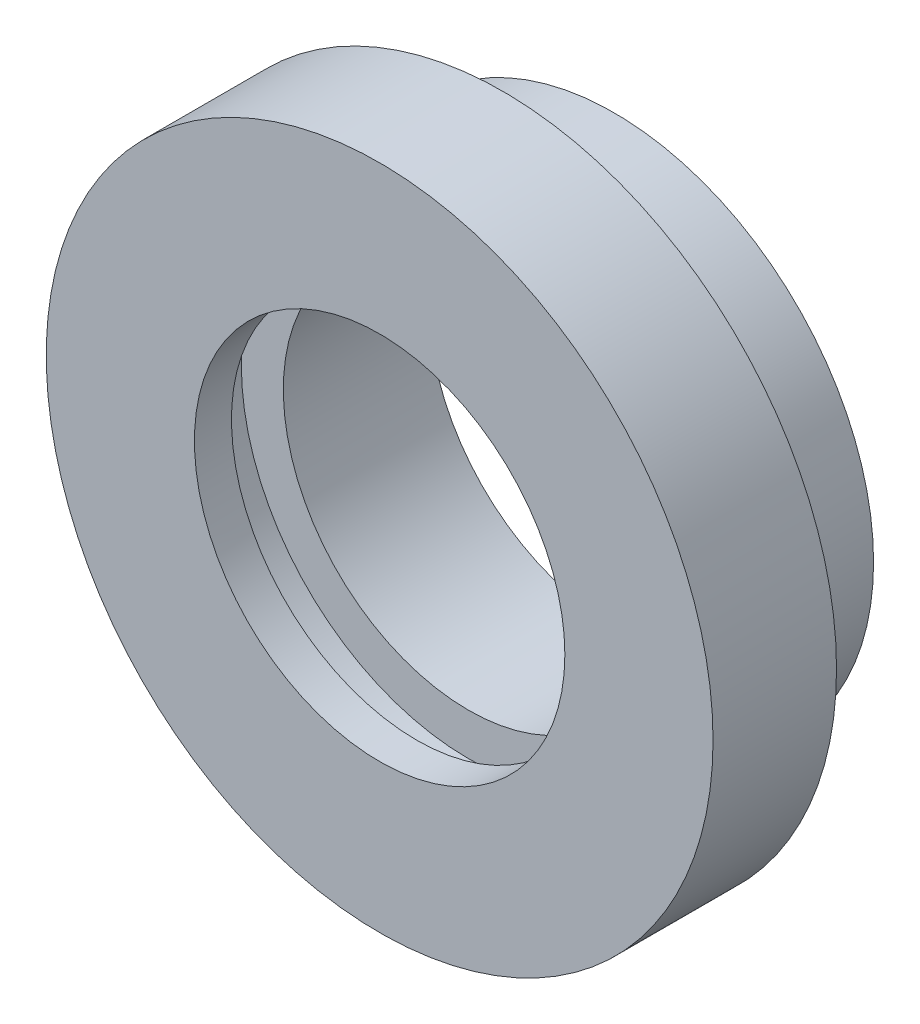
ISO-10303-21;
HEADER;
FILE_DESCRIPTION(('STEP AP214'),'2;1');
FILE_NAME('part.step','',(''),(''),'','','');
FILE_SCHEMA(('AUTOMOTIVE_DESIGN { 1 0 10303 214 1 1 1 1 }'));
ENDSEC;
DATA;
#1=APPLICATION_CONTEXT('core data for automotive mechanical design processes');
#2=APPLICATION_PROTOCOL_DEFINITION('international standard','automotive_design',2000,#1);
#3=PRODUCT_CONTEXT('',#1,'mechanical');
#4=PRODUCT('Part','Part','',(#3));
#5=PRODUCT_RELATED_PRODUCT_CATEGORY('part','',(#4));
#6=PRODUCT_DEFINITION_FORMATION('','',#4);
#7=PRODUCT_DEFINITION_CONTEXT('part definition',#1,'design');
#8=PRODUCT_DEFINITION('design','',#6,#7);
#9=PRODUCT_DEFINITION_SHAPE('','',#8);
#10=(LENGTH_UNIT() NAMED_UNIT(*) SI_UNIT(.MILLI.,.METRE.));
#11=(NAMED_UNIT(*) PLANE_ANGLE_UNIT() SI_UNIT($,.RADIAN.));
#12=(NAMED_UNIT(*) SI_UNIT($,.STERADIAN.) SOLID_ANGLE_UNIT());
#13=UNCERTAINTY_MEASURE_WITH_UNIT(LENGTH_MEASURE(1.E-05),#10,'distance_accuracy_value','');
#14=(GEOMETRIC_REPRESENTATION_CONTEXT(3) GLOBAL_UNCERTAINTY_ASSIGNED_CONTEXT((#13)) GLOBAL_UNIT_ASSIGNED_CONTEXT((#10,
#11,#12)) REPRESENTATION_CONTEXT('',''));
#15=CARTESIAN_POINT('',(0.,0.,0.));
#16=DIRECTION('',(0.,0.,1.));
#17=DIRECTION('',(1.,0.,0.));
#18=AXIS2_PLACEMENT_3D('',#15,#16,#17);
#19=CARTESIAN_POINT('',(0.,0.,0.));
#20=DIRECTION('',(0.,0.,1.));
#21=DIRECTION('',(1.,0.,0.));
#22=AXIS2_PLACEMENT_3D('',#19,#20,#21);
#23=CYLINDRICAL_SURFACE('',#22,15.);
#24=CARTESIAN_POINT('',(0.,0.,-135.));
#25=DIRECTION('',(0.,0.,1.));
#26=DIRECTION('',(1.,0.,0.));
#27=AXIS2_PLACEMENT_3D('',#24,#25,#26);
#28=CIRCLE('',#27,15.);
#29=CARTESIAN_POINT('',(15.,0.,-135.));
#30=VERTEX_POINT('',#29);
#31=EDGE_CURVE('E42',#30,#30,#28,.T.);
#32=ORIENTED_EDGE('',*,*,#31,.T.);
#33=EDGE_LOOP('',(#32));
#34=FACE_BOUND('',#33,.T.);
#35=CARTESIAN_POINT('',(0.,0.,-138.));
#36=DIRECTION('',(0.,0.,1.));
#37=DIRECTION('',(0.,-1.,0.));
#38=AXIS2_PLACEMENT_3D('',#35,#36,#37);
#39=CIRCLE('',#38,15.);
#40=CARTESIAN_POINT('',(0.,-15.,-138.));
#41=VERTEX_POINT('',#40);
#42=EDGE_CURVE('E70',#41,#41,#39,.T.);
#43=ORIENTED_EDGE('',*,*,#42,.F.);
#44=EDGE_LOOP('',(#43));
#45=FACE_BOUND('',#44,.T.);
#46=ADVANCED_FACE('F35',(#34,#45),#23,.F.);
#47=CARTESIAN_POINT('',(0.,0.,-154.));
#48=DIRECTION('',(0.,0.,1.));
#49=DIRECTION('',(1.,0.,0.));
#50=AXIS2_PLACEMENT_3D('',#47,#48,#49);
#51=CIRCLE('',#50,15.);
#52=CARTESIAN_POINT('',(15.,0.,-154.));
#53=VERTEX_POINT('',#52);
#54=EDGE_CURVE('E46',#53,#53,#51,.T.);
#55=ORIENTED_EDGE('',*,*,#54,.F.);
#56=EDGE_LOOP('',(#55));
#57=FACE_BOUND('',#56,.T.);
#58=CARTESIAN_POINT('',(0.,0.,-142.2));
#59=DIRECTION('',(0.,0.,1.));
#60=DIRECTION('',(0.,-1.,0.));
#61=AXIS2_PLACEMENT_3D('',#58,#59,#60);
#62=CIRCLE('',#61,15.);
#63=CARTESIAN_POINT('',(0.,-15.,-142.2));
#64=VERTEX_POINT('',#63);
#65=EDGE_CURVE('E67',#64,#64,#62,.T.);
#66=ORIENTED_EDGE('',*,*,#65,.T.);
#67=EDGE_LOOP('',(#66));
#68=FACE_BOUND('',#67,.T.);
#69=ADVANCED_FACE('F78',(#57,#68),#23,.F.);
#70=CARTESIAN_POINT('',(0.,0.,0.));
#71=DIRECTION('',(0.,0.,1.));
#72=DIRECTION('',(1.,0.,0.));
#73=AXIS2_PLACEMENT_3D('',#70,#71,#72);
#74=CYLINDRICAL_SURFACE('',#73,27.);
#75=CARTESIAN_POINT('',(0.,0.,-135.));
#76=DIRECTION('',(0.,0.,1.));
#77=DIRECTION('',(1.,0.,0.));
#78=AXIS2_PLACEMENT_3D('',#75,#76,#77);
#79=CIRCLE('',#78,27.);
#80=CARTESIAN_POINT('',(27.,0.,-135.));
#81=VERTEX_POINT('',#80);
#82=EDGE_CURVE('E10',#81,#81,#79,.T.);
#83=ORIENTED_EDGE('',*,*,#82,.F.);
#84=EDGE_LOOP('',(#83));
#85=FACE_BOUND('',#84,.T.);
#86=CARTESIAN_POINT('',(0.,0.,-145.));
#87=DIRECTION('',(0.,0.,1.));
#88=DIRECTION('',(1.,0.,0.));
#89=AXIS2_PLACEMENT_3D('',#86,#87,#88);
#90=CIRCLE('',#89,27.);
#91=CARTESIAN_POINT('',(27.,0.,-145.));
#92=VERTEX_POINT('',#91);
#93=EDGE_CURVE('E58',#92,#92,#90,.T.);
#94=ORIENTED_EDGE('',*,*,#93,.T.);
#95=EDGE_LOOP('',(#94));
#96=FACE_BOUND('',#95,.T.);
#97=ADVANCED_FACE('F37',(#85,#96),#74,.T.);
#98=CARTESIAN_POINT('',(0.,0.,-135.));
#99=DIRECTION('',(0.,0.,-1.));
#100=DIRECTION('',(-1.,0.,0.));
#101=AXIS2_PLACEMENT_3D('',#98,#99,#100);
#102=PLANE('',#101);
#103=ORIENTED_EDGE('',*,*,#31,.F.);
#104=EDGE_LOOP('',(#103));
#105=FACE_BOUND('',#104,.T.);
#106=ORIENTED_EDGE('',*,*,#82,.T.);
#107=EDGE_LOOP('',(#106));
#108=FACE_BOUND('',#107,.T.);
#109=ADVANCED_FACE('F87',(#105,#108),#102,.F.);
#110=CARTESIAN_POINT('',(0.,0.,-154.));
#111=DIRECTION('',(0.,0.,1.));
#112=DIRECTION('',(1.,0.,0.));
#113=AXIS2_PLACEMENT_3D('',#110,#111,#112);
#114=PLANE('',#113);
#115=CARTESIAN_POINT('',(0.,0.,-154.));
#116=DIRECTION('',(0.,0.,1.));
#117=DIRECTION('',(1.,0.,0.));
#118=AXIS2_PLACEMENT_3D('',#115,#116,#117);
#119=CIRCLE('',#118,21.);
#120=CARTESIAN_POINT('',(21.,0.,-154.));
#121=VERTEX_POINT('',#120);
#122=EDGE_CURVE('E50',#121,#121,#119,.T.);
#123=ORIENTED_EDGE('',*,*,#122,.F.);
#124=EDGE_LOOP('',(#123));
#125=FACE_BOUND('',#124,.T.);
#126=ORIENTED_EDGE('',*,*,#54,.T.);
#127=EDGE_LOOP('',(#126));
#128=FACE_BOUND('',#127,.T.);
#129=ADVANCED_FACE('F85',(#125,#128),#114,.F.);
#130=CARTESIAN_POINT('',(0.,0.,0.));
#131=DIRECTION('',(0.,0.,1.));
#132=DIRECTION('',(1.,0.,0.));
#133=AXIS2_PLACEMENT_3D('',#130,#131,#132);
#134=CYLINDRICAL_SURFACE('',#133,21.);
#135=CARTESIAN_POINT('',(0.,0.,-145.));
#136=DIRECTION('',(0.,0.,1.));
#137=DIRECTION('',(1.,0.,0.));
#138=AXIS2_PLACEMENT_3D('',#135,#136,#137);
#139=CIRCLE('',#138,21.);
#140=CARTESIAN_POINT('',(21.,0.,-145.));
#141=VERTEX_POINT('',#140);
#142=EDGE_CURVE('E55',#141,#141,#139,.T.);
#143=ORIENTED_EDGE('',*,*,#142,.F.);
#144=EDGE_LOOP('',(#143));
#145=FACE_BOUND('',#144,.T.);
#146=ORIENTED_EDGE('',*,*,#122,.T.);
#147=EDGE_LOOP('',(#146));
#148=FACE_BOUND('',#147,.T.);
#149=ADVANCED_FACE('F94',(#145,#148),#134,.T.);
#150=CARTESIAN_POINT('',(0.,0.,-145.));
#151=DIRECTION('',(0.,0.,1.));
#152=DIRECTION('',(1.,0.,0.));
#153=AXIS2_PLACEMENT_3D('',#150,#151,#152);
#154=PLANE('',#153);
#155=ORIENTED_EDGE('',*,*,#93,.F.);
#156=EDGE_LOOP('',(#155));
#157=FACE_BOUND('',#156,.T.);
#158=ORIENTED_EDGE('',*,*,#142,.T.);
#159=EDGE_LOOP('',(#158));
#160=FACE_BOUND('',#159,.T.);
#161=ADVANCED_FACE('F102',(#157,#160),#154,.F.);
#162=CARTESIAN_POINT('',(0.,15.,-138.));
#163=DIRECTION('',(0.,0.,-1.));
#164=DIRECTION('',(0.,1.,0.));
#165=AXIS2_PLACEMENT_3D('',#162,#163,#164);
#166=PLANE('',#165);
#167=ORIENTED_EDGE('',*,*,#42,.T.);
#168=EDGE_LOOP('',(#167));
#169=FACE_BOUND('',#168,.T.);
#170=CARTESIAN_POINT('',(0.,0.,-138.));
#171=DIRECTION('',(0.,0.,1.));
#172=DIRECTION('',(0.,-1.,0.));
#173=AXIS2_PLACEMENT_3D('',#170,#171,#172);
#174=CIRCLE('',#173,18.4);
#175=CARTESIAN_POINT('',(0.,-18.4,-138.));
#176=VERTEX_POINT('',#175);
#177=EDGE_CURVE('E61',#176,#176,#174,.T.);
#178=ORIENTED_EDGE('',*,*,#177,.F.);
#179=EDGE_LOOP('',(#178));
#180=FACE_BOUND('',#179,.T.);
#181=ADVANCED_FACE('F74',(#169,#180),#166,.T.);
#182=CARTESIAN_POINT('',(0.,0.,0.));
#183=DIRECTION('',(0.,0.,1.));
#184=DIRECTION('',(0.,-1.,0.));
#185=AXIS2_PLACEMENT_3D('',#182,#183,#184);
#186=CYLINDRICAL_SURFACE('',#185,18.4);
#187=ORIENTED_EDGE('',*,*,#177,.T.);
#188=EDGE_LOOP('',(#187));
#189=FACE_BOUND('',#188,.T.);
#190=CARTESIAN_POINT('',(0.,0.,-142.2));
#191=DIRECTION('',(0.,0.,1.));
#192=DIRECTION('',(0.,-1.,0.));
#193=AXIS2_PLACEMENT_3D('',#190,#191,#192);
#194=CIRCLE('',#193,18.4);
#195=CARTESIAN_POINT('',(0.,-18.4,-142.2));
#196=VERTEX_POINT('',#195);
#197=EDGE_CURVE('E64',#196,#196,#194,.T.);
#198=ORIENTED_EDGE('',*,*,#197,.F.);
#199=EDGE_LOOP('',(#198));
#200=FACE_BOUND('',#199,.T.);
#201=ADVANCED_FACE('F118',(#189,#200),#186,.F.);
#202=CARTESIAN_POINT('',(0.,15.,-142.2));
#203=DIRECTION('',(0.,0.,1.));
#204=DIRECTION('',(0.,-1.,0.));
#205=AXIS2_PLACEMENT_3D('',#202,#203,#204);
#206=PLANE('',#205);
#207=ORIENTED_EDGE('',*,*,#197,.T.);
#208=EDGE_LOOP('',(#207));
#209=FACE_BOUND('',#208,.T.);
#210=ORIENTED_EDGE('',*,*,#65,.F.);
#211=EDGE_LOOP('',(#210));
#212=FACE_BOUND('',#211,.T.);
#213=ADVANCED_FACE('F116',(#209,#212),#206,.T.);
#214=CLOSED_SHELL('',(#46,#69,#97,#109,#129,#149,#161,#181,#201,#213));
#215=MANIFOLD_SOLID_BREP('B2',#214);
#216=ADVANCED_BREP_SHAPE_REPRESENTATION('',(#18,#215),#14);
#217=SHAPE_DEFINITION_REPRESENTATION(#9,#216);
ENDSEC;
END-ISO-10303-21;
